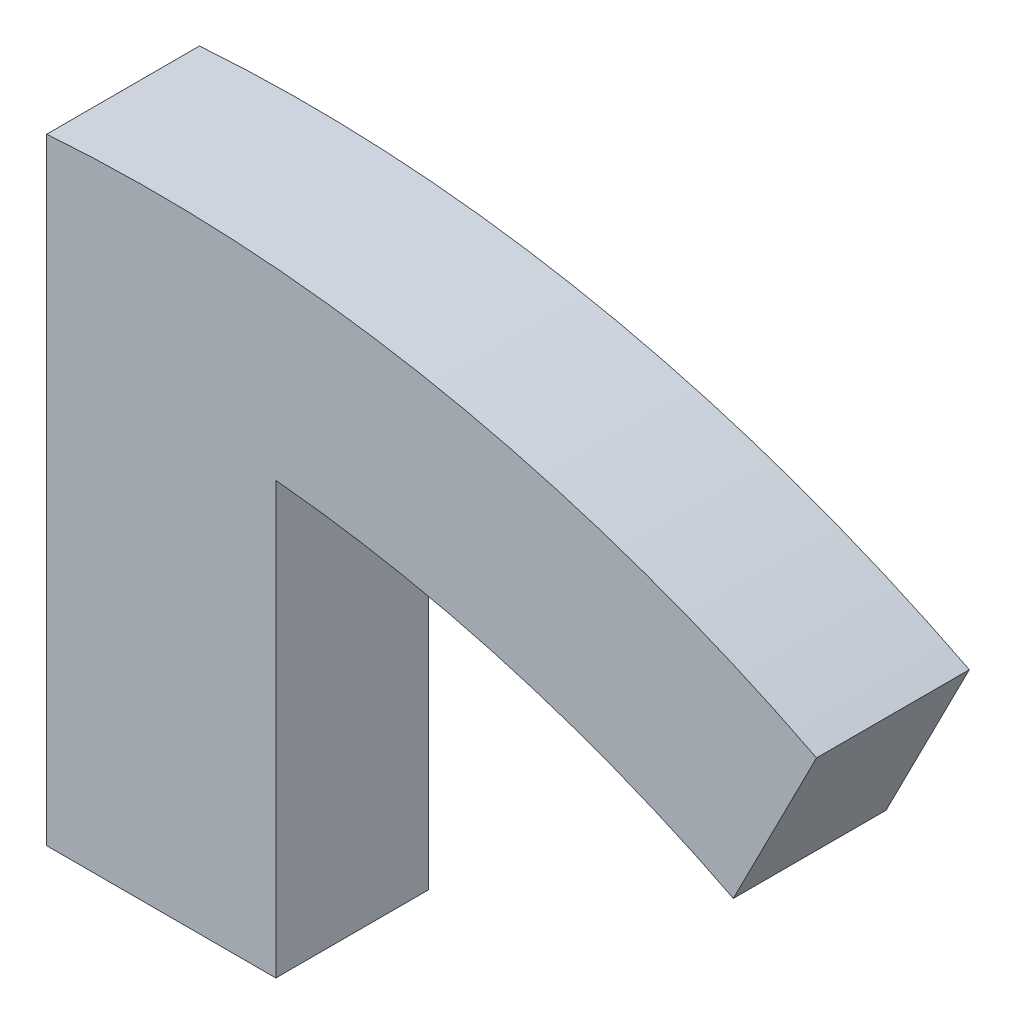
ISO-10303-21;
HEADER;
FILE_DESCRIPTION(('STEP AP214'),'2;1');
FILE_NAME('part.step','',(''),(''),'','','');
FILE_SCHEMA(('AUTOMOTIVE_DESIGN { 1 0 10303 214 1 1 1 1 }'));
ENDSEC;
DATA;
#1=APPLICATION_CONTEXT('core data for automotive mechanical design processes');
#2=APPLICATION_PROTOCOL_DEFINITION('international standard','automotive_design',2000,#1);
#3=PRODUCT_CONTEXT('',#1,'mechanical');
#4=PRODUCT('Part','Part','',(#3));
#5=PRODUCT_RELATED_PRODUCT_CATEGORY('part','',(#4));
#6=PRODUCT_DEFINITION_FORMATION('','',#4);
#7=PRODUCT_DEFINITION_CONTEXT('part definition',#1,'design');
#8=PRODUCT_DEFINITION('design','',#6,#7);
#9=PRODUCT_DEFINITION_SHAPE('','',#8);
#10=(LENGTH_UNIT() NAMED_UNIT(*) SI_UNIT(.MILLI.,.METRE.));
#11=(NAMED_UNIT(*) PLANE_ANGLE_UNIT() SI_UNIT($,.RADIAN.));
#12=(NAMED_UNIT(*) SI_UNIT($,.STERADIAN.) SOLID_ANGLE_UNIT());
#13=UNCERTAINTY_MEASURE_WITH_UNIT(LENGTH_MEASURE(1.E-05),#10,'distance_accuracy_value','');
#14=(GEOMETRIC_REPRESENTATION_CONTEXT(3) GLOBAL_UNCERTAINTY_ASSIGNED_CONTEXT((#13)) GLOBAL_UNIT_ASSIGNED_CONTEXT((#10,
#11,#12)) REPRESENTATION_CONTEXT('',''));
#15=CARTESIAN_POINT('',(0.,0.,0.));
#16=DIRECTION('',(0.,0.,1.));
#17=DIRECTION('',(1.,0.,0.));
#18=AXIS2_PLACEMENT_3D('',#15,#16,#17);
#19=CARTESIAN_POINT('',(7.99999999999999,83.2163445484119,5.));
#20=DIRECTION('',(-1.,0.,0.));
#21=DIRECTION('',(0.,-1.,0.));
#22=AXIS2_PLACEMENT_3D('',#19,#20,#21);
#23=PLANE('',#22);
#24=DIRECTION('',(0.,1.,0.));
#25=VECTOR('',#24,1.);
#26=CARTESIAN_POINT('',(7.99999999999999,83.2163445484119,-5.));
#27=LINE('',#26,#25);
#28=CARTESIAN_POINT('',(8.,55.,-5.));
#29=VERTEX_POINT('',#28);
#30=CARTESIAN_POINT('',(7.99999999999998,83.2163445484119,-5.));
#31=VERTEX_POINT('',#30);
#32=EDGE_CURVE('E123',#29,#31,#27,.T.);
#33=ORIENTED_EDGE('',*,*,#32,.T.);
#34=DIRECTION('',(0.,0.,-1.));
#35=VECTOR('',#34,1.);
#36=CARTESIAN_POINT('',(7.99999999999998,83.2163445484119,5.));
#37=LINE('',#36,#35);
#38=CARTESIAN_POINT('',(7.99999999999998,83.2163445484119,5.));
#39=VERTEX_POINT('',#38);
#40=EDGE_CURVE('E43',#39,#31,#37,.T.);
#41=ORIENTED_EDGE('',*,*,#40,.F.);
#42=DIRECTION('',(0.,1.,0.));
#43=VECTOR('',#42,1.);
#44=CARTESIAN_POINT('',(7.99999999999999,83.2163445484119,5.));
#45=LINE('',#44,#43);
#46=CARTESIAN_POINT('',(8.,55.,5.));
#47=VERTEX_POINT('',#46);
#48=EDGE_CURVE('E89',#47,#39,#45,.T.);
#49=ORIENTED_EDGE('',*,*,#48,.F.);
#50=DIRECTION('',(0.,0.,-1.));
#51=VECTOR('',#50,1.);
#52=CARTESIAN_POINT('',(8.,55.,5.));
#53=LINE('',#52,#51);
#54=EDGE_CURVE('E11',#47,#29,#53,.T.);
#55=ORIENTED_EDGE('',*,*,#54,.T.);
#56=EDGE_LOOP('',(#33,#41,#49,#55));
#57=FACE_BOUND('',#56,.T.);
#58=ADVANCED_FACE('F35',(#57),#23,.F.);
#59=CARTESIAN_POINT('',(0.,0.,5.));
#60=DIRECTION('',(0.,0.,-1.));
#61=DIRECTION('',(-1.,0.,0.));
#62=AXIS2_PLACEMENT_3D('',#59,#60,#61);
#63=CYLINDRICAL_SURFACE('',#62,83.6);
#64=CARTESIAN_POINT('',(0.,0.,-5.));
#65=DIRECTION('',(0.,0.,-1.));
#66=DIRECTION('',(-1.,0.,0.));
#67=AXIS2_PLACEMENT_3D('',#64,#65,#66);
#68=CIRCLE('',#67,83.6);
#69=CARTESIAN_POINT('',(37.9536057782262,74.4881454221475,-5.));
#70=VERTEX_POINT('',#69);
#71=EDGE_CURVE('E125',#31,#70,#68,.T.);
#72=ORIENTED_EDGE('',*,*,#71,.T.);
#73=DIRECTION('',(0.,0.,-1.));
#74=VECTOR('',#73,1.);
#75=CARTESIAN_POINT('',(37.9536057782262,74.4881454221475,5.));
#76=LINE('',#75,#74);
#77=CARTESIAN_POINT('',(37.9536057782262,74.4881454221475,5.));
#78=VERTEX_POINT('',#77);
#79=EDGE_CURVE('E112',#78,#70,#76,.T.);
#80=ORIENTED_EDGE('',*,*,#79,.F.);
#81=CARTESIAN_POINT('',(0.,0.,5.));
#82=DIRECTION('',(0.,0.,-1.));
#83=DIRECTION('',(-1.,0.,0.));
#84=AXIS2_PLACEMENT_3D('',#81,#82,#83);
#85=CIRCLE('',#84,83.6);
#86=EDGE_CURVE('E103',#39,#78,#85,.T.);
#87=ORIENTED_EDGE('',*,*,#86,.F.);
#88=ORIENTED_EDGE('',*,*,#40,.T.);
#89=EDGE_LOOP('',(#72,#80,#87,#88));
#90=FACE_BOUND('',#89,.T.);
#91=ADVANCED_FACE('F137',(#90),#63,.F.);
#92=CARTESIAN_POINT('',(37.9536057782262,74.4881454221475,5.));
#93=DIRECTION('',(-0.891006524188367,0.453990499739548,0.));
#94=DIRECTION('',(-0.453990499739548,-0.891006524188367,0.));
#95=AXIS2_PLACEMENT_3D('',#92,#93,#94);
#96=PLANE('',#95);
#97=DIRECTION('',(0.453990499739548,0.891006524188367,0.));
#98=VECTOR('',#97,1.);
#99=CARTESIAN_POINT('',(37.9536057782262,74.4881454221475,-5.));
#100=LINE('',#99,#98);
#101=CARTESIAN_POINT('',(43.4014917751008,85.1802237124079,-5.));
#102=VERTEX_POINT('',#101);
#103=EDGE_CURVE('E111',#70,#102,#100,.T.);
#104=ORIENTED_EDGE('',*,*,#103,.T.);
#105=DIRECTION('',(0.,0.,-1.));
#106=VECTOR('',#105,1.);
#107=CARTESIAN_POINT('',(43.4014917751008,85.1802237124079,5.));
#108=LINE('',#107,#106);
#109=CARTESIAN_POINT('',(43.4014917751008,85.1802237124079,5.));
#110=VERTEX_POINT('',#109);
#111=EDGE_CURVE('E108',#110,#102,#108,.T.);
#112=ORIENTED_EDGE('',*,*,#111,.F.);
#113=DIRECTION('',(0.453990499739548,0.891006524188367,0.));
#114=VECTOR('',#113,1.);
#115=CARTESIAN_POINT('',(37.9536057782262,74.4881454221475,5.));
#116=LINE('',#115,#114);
#117=EDGE_CURVE('E97',#78,#110,#116,.T.);
#118=ORIENTED_EDGE('',*,*,#117,.F.);
#119=ORIENTED_EDGE('',*,*,#79,.T.);
#120=EDGE_LOOP('',(#104,#112,#118,#119));
#121=FACE_BOUND('',#120,.T.);
#122=ADVANCED_FACE('F109',(#121),#96,.F.);
#123=CARTESIAN_POINT('',(0.,0.,5.));
#124=DIRECTION('',(0.,0.,-1.));
#125=DIRECTION('',(-1.,0.,0.));
#126=AXIS2_PLACEMENT_3D('',#123,#124,#125);
#127=CYLINDRICAL_SURFACE('',#126,95.6);
#128=CARTESIAN_POINT('',(0.,0.,-5.));
#129=DIRECTION('',(0.,0.,1.));
#130=DIRECTION('',(-1.,0.,0.));
#131=AXIS2_PLACEMENT_3D('',#128,#129,#130);
#132=CIRCLE('',#131,95.6);
#133=CARTESIAN_POINT('',(-7.00000000000001,95.3433794240586,-5.));
#134=VERTEX_POINT('',#133);
#135=EDGE_CURVE('E75',#102,#134,#132,.T.);
#136=ORIENTED_EDGE('',*,*,#135,.T.);
#137=DIRECTION('',(0.,0.,-1.));
#138=VECTOR('',#137,1.);
#139=CARTESIAN_POINT('',(-7.00000000000001,95.3433794240586,5.));
#140=LINE('',#139,#138);
#141=CARTESIAN_POINT('',(-7.00000000000001,95.3433794240586,5.));
#142=VERTEX_POINT('',#141);
#143=EDGE_CURVE('E113',#142,#134,#140,.T.);
#144=ORIENTED_EDGE('',*,*,#143,.F.);
#145=CARTESIAN_POINT('',(0.,0.,5.));
#146=DIRECTION('',(0.,0.,1.));
#147=DIRECTION('',(-1.,0.,0.));
#148=AXIS2_PLACEMENT_3D('',#145,#146,#147);
#149=CIRCLE('',#148,95.6);
#150=EDGE_CURVE('E101',#110,#142,#149,.T.);
#151=ORIENTED_EDGE('',*,*,#150,.F.);
#152=ORIENTED_EDGE('',*,*,#111,.T.);
#153=EDGE_LOOP('',(#136,#144,#151,#152));
#154=FACE_BOUND('',#153,.T.);
#155=ADVANCED_FACE('F115',(#154),#127,.T.);
#156=CARTESIAN_POINT('',(-7.00000000000001,55.,5.));
#157=DIRECTION('',(1.,0.,0.));
#158=DIRECTION('',(0.,0.,-1.));
#159=AXIS2_PLACEMENT_3D('',#156,#157,#158);
#160=PLANE('',#159);
#161=DIRECTION('',(0.,-1.,0.));
#162=VECTOR('',#161,1.);
#163=CARTESIAN_POINT('',(-7.00000000000001,55.,-5.));
#164=LINE('',#163,#162);
#165=CARTESIAN_POINT('',(-7.00000000000001,55.,-5.));
#166=VERTEX_POINT('',#165);
#167=EDGE_CURVE('E82',#134,#166,#164,.T.);
#168=ORIENTED_EDGE('',*,*,#167,.T.);
#169=DIRECTION('',(0.,0.,-1.));
#170=VECTOR('',#169,1.);
#171=CARTESIAN_POINT('',(-7.00000000000001,55.,5.));
#172=LINE('',#171,#170);
#173=CARTESIAN_POINT('',(-7.00000000000001,55.,5.));
#174=VERTEX_POINT('',#173);
#175=EDGE_CURVE('E119',#174,#166,#172,.T.);
#176=ORIENTED_EDGE('',*,*,#175,.F.);
#177=DIRECTION('',(0.,-1.,0.));
#178=VECTOR('',#177,1.);
#179=CARTESIAN_POINT('',(-7.00000000000001,55.,5.));
#180=LINE('',#179,#178);
#181=EDGE_CURVE('E117',#142,#174,#180,.T.);
#182=ORIENTED_EDGE('',*,*,#181,.F.);
#183=ORIENTED_EDGE('',*,*,#143,.T.);
#184=EDGE_LOOP('',(#168,#176,#182,#183));
#185=FACE_BOUND('',#184,.T.);
#186=ADVANCED_FACE('F143',(#185),#160,.F.);
#187=CARTESIAN_POINT('',(0.,55.,5.));
#188=DIRECTION('',(0.,1.,0.));
#189=DIRECTION('',(0.,0.,1.));
#190=AXIS2_PLACEMENT_3D('',#187,#188,#189);
#191=PLANE('',#190);
#192=DIRECTION('',(1.,0.,0.));
#193=VECTOR('',#192,1.);
#194=CARTESIAN_POINT('',(0.,55.,-5.));
#195=LINE('',#194,#193);
#196=EDGE_CURVE('E130',#166,#29,#195,.T.);
#197=ORIENTED_EDGE('',*,*,#196,.T.);
#198=ORIENTED_EDGE('',*,*,#54,.F.);
#199=DIRECTION('',(1.,0.,0.));
#200=VECTOR('',#199,1.);
#201=CARTESIAN_POINT('',(0.,55.,5.));
#202=LINE('',#201,#200);
#203=EDGE_CURVE('E51',#174,#47,#202,.T.);
#204=ORIENTED_EDGE('',*,*,#203,.F.);
#205=ORIENTED_EDGE('',*,*,#175,.T.);
#206=EDGE_LOOP('',(#197,#198,#204,#205));
#207=FACE_BOUND('',#206,.T.);
#208=ADVANCED_FACE('F142',(#207),#191,.F.);
#209=CARTESIAN_POINT('',(0.,0.,5.));
#210=DIRECTION('',(0.,0.,-1.));
#211=DIRECTION('',(-1.,0.,0.));
#212=AXIS2_PLACEMENT_3D('',#209,#210,#211);
#213=PLANE('',#212);
#214=ORIENTED_EDGE('',*,*,#203,.T.);
#215=ORIENTED_EDGE('',*,*,#48,.T.);
#216=ORIENTED_EDGE('',*,*,#86,.T.);
#217=ORIENTED_EDGE('',*,*,#117,.T.);
#218=ORIENTED_EDGE('',*,*,#150,.T.);
#219=ORIENTED_EDGE('',*,*,#181,.T.);
#220=EDGE_LOOP('',(#214,#215,#216,#217,#218,#219));
#221=FACE_BOUND('',#220,.T.);
#222=ADVANCED_FACE('F99',(#221),#213,.F.);
#223=CARTESIAN_POINT('',(0.,0.,-5.));
#224=DIRECTION('',(0.,0.,-1.));
#225=DIRECTION('',(-1.,0.,0.));
#226=AXIS2_PLACEMENT_3D('',#223,#224,#225);
#227=PLANE('',#226);
#228=ORIENTED_EDGE('',*,*,#32,.F.);
#229=ORIENTED_EDGE('',*,*,#196,.F.);
#230=ORIENTED_EDGE('',*,*,#167,.F.);
#231=ORIENTED_EDGE('',*,*,#135,.F.);
#232=ORIENTED_EDGE('',*,*,#103,.F.);
#233=ORIENTED_EDGE('',*,*,#71,.F.);
#234=EDGE_LOOP('',(#228,#229,#230,#231,#232,#233));
#235=FACE_BOUND('',#234,.T.);
#236=ADVANCED_FACE('F140',(#235),#227,.T.);
#237=CLOSED_SHELL('',(#58,#91,#122,#155,#186,#208,#222,#236));
#238=MANIFOLD_SOLID_BREP('B2',#237);
#239=ADVANCED_BREP_SHAPE_REPRESENTATION('',(#18,#238),#14);
#240=SHAPE_DEFINITION_REPRESENTATION(#9,#239);
ENDSEC;
END-ISO-10303-21;
